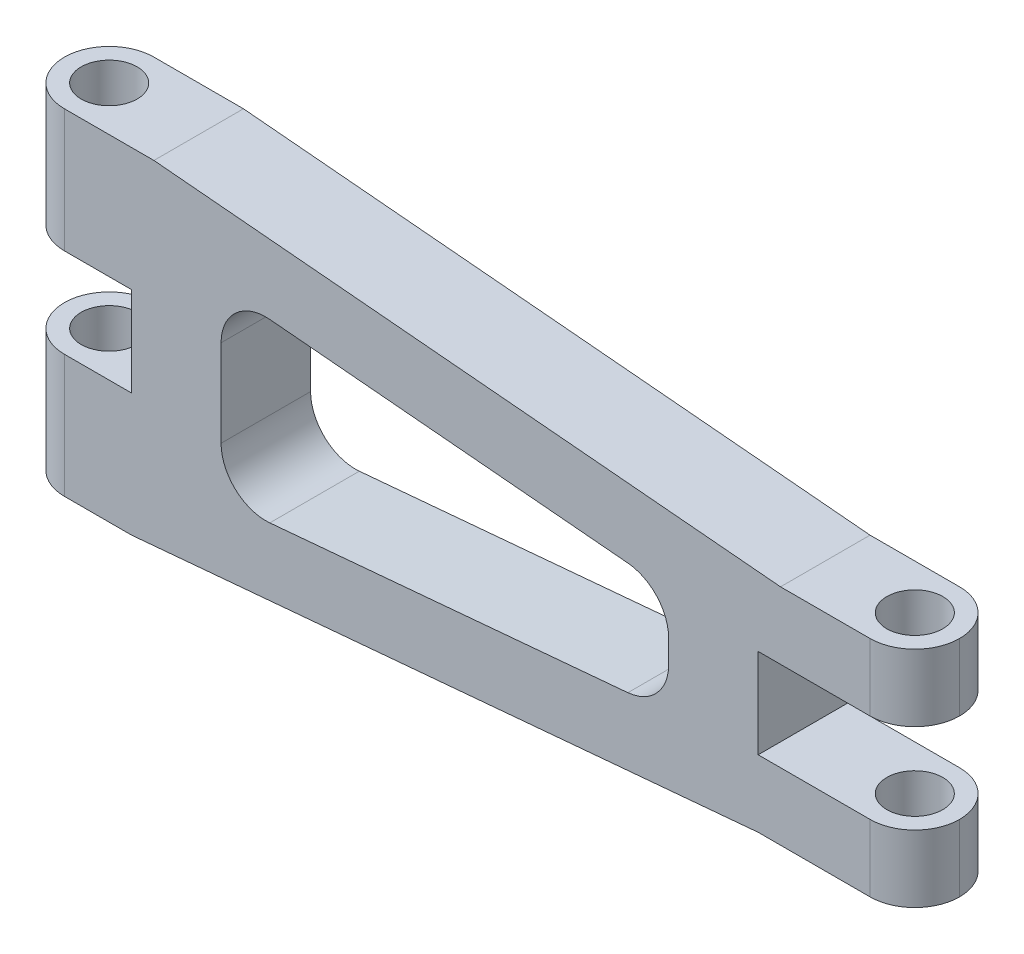
ISO-10303-21;
HEADER;
FILE_DESCRIPTION(('STEP AP214'),'2;1');
FILE_NAME('part.step','',(''),(''),'','','');
FILE_SCHEMA(('AUTOMOTIVE_DESIGN { 1 0 10303 214 1 1 1 1 }'));
ENDSEC;
DATA;
#1=APPLICATION_CONTEXT('core data for automotive mechanical design processes');
#2=APPLICATION_PROTOCOL_DEFINITION('international standard','automotive_design',2000,#1);
#3=PRODUCT_CONTEXT('',#1,'mechanical');
#4=PRODUCT('Part','Part','',(#3));
#5=PRODUCT_RELATED_PRODUCT_CATEGORY('part','',(#4));
#6=PRODUCT_DEFINITION_FORMATION('','',#4);
#7=PRODUCT_DEFINITION_CONTEXT('part definition',#1,'design');
#8=PRODUCT_DEFINITION('design','',#6,#7);
#9=PRODUCT_DEFINITION_SHAPE('','',#8);
#10=(LENGTH_UNIT() NAMED_UNIT(*) SI_UNIT(.MILLI.,.METRE.));
#11=(NAMED_UNIT(*) PLANE_ANGLE_UNIT() SI_UNIT($,.RADIAN.));
#12=(NAMED_UNIT(*) SI_UNIT($,.STERADIAN.) SOLID_ANGLE_UNIT());
#13=UNCERTAINTY_MEASURE_WITH_UNIT(LENGTH_MEASURE(1.E-05),#10,'distance_accuracy_value','');
#14=(GEOMETRIC_REPRESENTATION_CONTEXT(3) GLOBAL_UNCERTAINTY_ASSIGNED_CONTEXT((#13)) GLOBAL_UNIT_ASSIGNED_CONTEXT((#10,
#11,#12)) REPRESENTATION_CONTEXT('',''));
#15=CARTESIAN_POINT('',(0.,0.,0.));
#16=DIRECTION('',(0.,0.,1.));
#17=DIRECTION('',(1.,0.,0.));
#18=AXIS2_PLACEMENT_3D('',#15,#16,#17);
#19=CARTESIAN_POINT('',(-24.646070990319,37.5,20.));
#20=DIRECTION('',(0.,0.,1.));
#21=DIRECTION('',(1.,0.,0.));
#22=AXIS2_PLACEMENT_3D('',#19,#20,#21);
#23=PLANE('',#22);
#24=DIRECTION('',(-1.,0.,0.));
#25=VECTOR('',#24,1.);
#26=CARTESIAN_POINT('',(5.35137052106982,37.5,20.));
#27=LINE('',#26,#25);
#28=CARTESIAN_POINT('',(5.35137052106982,37.5,20.));
#29=VERTEX_POINT('',#28);
#30=CARTESIAN_POINT('',(-14.646070990319,37.5,20.));
#31=VERTEX_POINT('',#30);
#32=EDGE_CURVE('E239',#29,#31,#27,.T.);
#33=ORIENTED_EDGE('',*,*,#32,.T.);
#34=DIRECTION('',(0.,-1.,0.));
#35=VECTOR('',#34,1.);
#36=CARTESIAN_POINT('',(-14.646070990319,9.99999999999999,20.));
#37=LINE('',#36,#35);
#38=CARTESIAN_POINT('',(-14.646070990319,9.99999999999999,20.));
#39=VERTEX_POINT('',#38);
#40=EDGE_CURVE('E236',#31,#39,#37,.T.);
#41=ORIENTED_EDGE('',*,*,#40,.T.);
#42=DIRECTION('',(1.,0.,0.));
#43=VECTOR('',#42,1.);
#44=CARTESIAN_POINT('',(-24.646070990319,9.99999999999999,20.));
#45=LINE('',#44,#43);
#46=CARTESIAN_POINT('',(0.353929009681016,9.99999999999999,20.));
#47=VERTEX_POINT('',#46);
#48=EDGE_CURVE('E229',#39,#47,#45,.T.);
#49=ORIENTED_EDGE('',*,*,#48,.T.);
#50=DIRECTION('',(0.,1.,0.));
#51=VECTOR('',#50,1.);
#52=CARTESIAN_POINT('',(0.353929009681016,-10.,20.));
#53=LINE('',#52,#51);
#54=CARTESIAN_POINT('',(0.353929009681016,-10.,20.));
#55=VERTEX_POINT('',#54);
#56=EDGE_CURVE('E234',#55,#47,#53,.T.);
#57=ORIENTED_EDGE('',*,*,#56,.F.);
#58=DIRECTION('',(-1.,0.,0.));
#59=VECTOR('',#58,1.);
#60=CARTESIAN_POINT('',(0.353929009681016,-10.,20.));
#61=LINE('',#60,#59);
#62=CARTESIAN_POINT('',(-14.646070990319,-10.,20.));
#63=VERTEX_POINT('',#62);
#64=EDGE_CURVE('E254',#55,#63,#61,.T.);
#65=ORIENTED_EDGE('',*,*,#64,.T.);
#66=DIRECTION('',(0.,-1.,0.));
#67=VECTOR('',#66,1.);
#68=CARTESIAN_POINT('',(-14.646070990319,-37.5,20.));
#69=LINE('',#68,#67);
#70=CARTESIAN_POINT('',(-14.646070990319,-37.5,20.));
#71=VERTEX_POINT('',#70);
#72=EDGE_CURVE('E350',#63,#71,#69,.T.);
#73=ORIENTED_EDGE('',*,*,#72,.T.);
#74=DIRECTION('',(-1.,0.,0.));
#75=VECTOR('',#74,1.);
#76=CARTESIAN_POINT('',(0.353929009681009,-37.5,20.));
#77=LINE('',#76,#75);
#78=CARTESIAN_POINT('',(0.353929009681009,-37.5,20.));
#79=VERTEX_POINT('',#78);
#80=EDGE_CURVE('E256',#79,#71,#77,.T.);
#81=ORIENTED_EDGE('',*,*,#80,.F.);
#82=DIRECTION('',(-0.996037705314462,-0.0889319379745055,0.));
#83=VECTOR('',#82,1.);
#84=CARTESIAN_POINT('',(140.353929009681,-25.,20.));
#85=LINE('',#84,#83);
#86=CARTESIAN_POINT('',(140.353929009681,-25.,20.));
#87=VERTEX_POINT('',#86);
#88=EDGE_CURVE('E262',#87,#79,#85,.T.);
#89=ORIENTED_EDGE('',*,*,#88,.F.);
#90=DIRECTION('',(1.,0.,0.));
#91=VECTOR('',#90,1.);
#92=CARTESIAN_POINT('',(140.353929009681,-25.,20.));
#93=LINE('',#92,#91);
#94=CARTESIAN_POINT('',(165.353929009681,-25.,20.));
#95=VERTEX_POINT('',#94);
#96=EDGE_CURVE('E265',#87,#95,#93,.T.);
#97=ORIENTED_EDGE('',*,*,#96,.T.);
#98=DIRECTION('',(0.,-1.,0.));
#99=VECTOR('',#98,1.);
#100=CARTESIAN_POINT('',(165.353929009681,37.5,20.));
#101=LINE('',#100,#99);
#102=CARTESIAN_POINT('',(165.353929009681,-10.,20.));
#103=VERTEX_POINT('',#102);
#104=EDGE_CURVE('E345',#95,#103,#101,.F.);
#105=ORIENTED_EDGE('',*,*,#104,.T.);
#106=DIRECTION('',(1.,0.,0.));
#107=VECTOR('',#106,1.);
#108=CARTESIAN_POINT('',(140.353929009681,-10.,20.));
#109=LINE('',#108,#107);
#110=CARTESIAN_POINT('',(140.353929009681,-10.,20.));
#111=VERTEX_POINT('',#110);
#112=EDGE_CURVE('E268',#111,#103,#109,.T.);
#113=ORIENTED_EDGE('',*,*,#112,.F.);
#114=DIRECTION('',(0.,1.,0.));
#115=VECTOR('',#114,1.);
#116=CARTESIAN_POINT('',(140.353929009681,-10.,20.));
#117=LINE('',#116,#115);
#118=CARTESIAN_POINT('',(140.353929009681,10.,20.));
#119=VERTEX_POINT('',#118);
#120=EDGE_CURVE('E271',#111,#119,#117,.T.);
#121=ORIENTED_EDGE('',*,*,#120,.T.);
#122=DIRECTION('',(-1.,0.,0.));
#123=VECTOR('',#122,1.);
#124=CARTESIAN_POINT('',(175.353929009681,9.99999999999999,20.));
#125=LINE('',#124,#123);
#126=CARTESIAN_POINT('',(165.353929009681,10.,20.));
#127=VERTEX_POINT('',#126);
#128=EDGE_CURVE('E274',#127,#119,#125,.T.);
#129=ORIENTED_EDGE('',*,*,#128,.F.);
#130=DIRECTION('',(0.,-1.,0.));
#131=VECTOR('',#130,1.);
#132=CARTESIAN_POINT('',(165.353929009681,37.5,20.));
#133=LINE('',#132,#131);
#134=CARTESIAN_POINT('',(165.353929009681,25.,20.));
#135=VERTEX_POINT('',#134);
#136=EDGE_CURVE('E348',#127,#135,#133,.F.);
#137=ORIENTED_EDGE('',*,*,#136,.T.);
#138=DIRECTION('',(1.,0.,0.));
#139=VECTOR('',#138,1.);
#140=CARTESIAN_POINT('',(145.35137052107,25.,20.));
#141=LINE('',#140,#139);
#142=CARTESIAN_POINT('',(145.35137052107,25.,20.));
#143=VERTEX_POINT('',#142);
#144=EDGE_CURVE('E276',#143,#135,#141,.T.);
#145=ORIENTED_EDGE('',*,*,#144,.F.);
#146=DIRECTION('',(-0.996037705314462,0.0889319379745055,0.));
#147=VECTOR('',#146,1.);
#148=CARTESIAN_POINT('',(145.35137052107,25.,20.));
#149=LINE('',#148,#147);
#150=EDGE_CURVE('E279',#143,#29,#149,.T.);
#151=ORIENTED_EDGE('',*,*,#150,.T.);
#152=EDGE_LOOP('',(#33,#41,#49,#57,#65,#73,#81,#89,#97,#105,#113,#121,#129,#137,#145,#151));
#153=FACE_BOUND('',#152,.T.);
#154=DIRECTION('',(-0.996037705314462,0.0889319379745054,0.));
#155=VECTOR('',#154,1.);
#156=CARTESIAN_POINT('',(120.353929009681,11.7260434319244,20.));
#157=LINE('',#156,#155);
#158=CARTESIAN_POINT('',(111.243248389426,12.5394970587329,20.));
#159=VERTEX_POINT('',#158);
#160=CARTESIAN_POINT('',(31.2432483894261,19.68235420159,20.));
#161=VERTEX_POINT('',#160);
#162=EDGE_CURVE('E445',#159,#161,#157,.T.);
#163=ORIENTED_EDGE('',*,*,#162,.F.);
#164=CARTESIAN_POINT('',(110.353929009681,2.57912000558823,20.));
#165=DIRECTION('',(0.,0.,1.));
#166=DIRECTION('',(1.,0.,0.));
#167=AXIS2_PLACEMENT_3D('',#164,#165,#166);
#168=CIRCLE('',#167,10.);
#169=CARTESIAN_POINT('',(120.353929009681,2.57912000558823,20.));
#170=VERTEX_POINT('',#169);
#171=EDGE_CURVE('E58',#159,#170,#168,.F.);
#172=ORIENTED_EDGE('',*,*,#171,.T.);
#173=DIRECTION('',(0.,1.,0.));
#174=VECTOR('',#173,1.);
#175=CARTESIAN_POINT('',(120.353929009681,-11.7260434319244,20.));
#176=LINE('',#175,#174);
#177=CARTESIAN_POINT('',(120.353929009681,-2.57912000558823,20.));
#178=VERTEX_POINT('',#177);
#179=EDGE_CURVE('E438',#178,#170,#176,.T.);
#180=ORIENTED_EDGE('',*,*,#179,.F.);
#181=CARTESIAN_POINT('',(110.353929009681,-2.57912000558823,20.));
#182=DIRECTION('',(0.,0.,1.));
#183=DIRECTION('',(1.,0.,0.));
#184=AXIS2_PLACEMENT_3D('',#181,#182,#183);
#185=CIRCLE('',#184,10.);
#186=CARTESIAN_POINT('',(111.243248389426,-12.5394970587329,20.));
#187=VERTEX_POINT('',#186);
#188=EDGE_CURVE('E11',#178,#187,#185,.F.);
#189=ORIENTED_EDGE('',*,*,#188,.T.);
#190=DIRECTION('',(-0.996037705314462,-0.0889319379745054,0.));
#191=VECTOR('',#190,1.);
#192=CARTESIAN_POINT('',(120.353929009681,-11.7260434319244,20.));
#193=LINE('',#192,#191);
#194=CARTESIAN_POINT('',(31.2432483894261,-19.68235420159,20.));
#195=VERTEX_POINT('',#194);
#196=EDGE_CURVE('E285',#187,#195,#193,.T.);
#197=ORIENTED_EDGE('',*,*,#196,.T.);
#198=CARTESIAN_POINT('',(30.353929009681,-9.72197714844537,20.));
#199=DIRECTION('',(0.,0.,1.));
#200=DIRECTION('',(1.,0.,0.));
#201=AXIS2_PLACEMENT_3D('',#198,#199,#200);
#202=CIRCLE('',#201,10.);
#203=CARTESIAN_POINT('',(20.353929009681,-9.72197714844537,20.));
#204=VERTEX_POINT('',#203);
#205=EDGE_CURVE('E417',#195,#204,#202,.F.);
#206=ORIENTED_EDGE('',*,*,#205,.T.);
#207=DIRECTION('',(0.,-1.,0.));
#208=VECTOR('',#207,1.);
#209=CARTESIAN_POINT('',(20.353929009681,20.6546148604958,20.));
#210=LINE('',#209,#208);
#211=CARTESIAN_POINT('',(20.353929009681,9.72197714844537,20.));
#212=VERTEX_POINT('',#211);
#213=EDGE_CURVE('E442',#212,#204,#210,.T.);
#214=ORIENTED_EDGE('',*,*,#213,.F.);
#215=CARTESIAN_POINT('',(30.353929009681,9.72197714844537,20.));
#216=DIRECTION('',(0.,0.,1.));
#217=DIRECTION('',(1.,0.,0.));
#218=AXIS2_PLACEMENT_3D('',#215,#216,#217);
#219=CIRCLE('',#218,10.);
#220=EDGE_CURVE('E413',#212,#161,#219,.F.);
#221=ORIENTED_EDGE('',*,*,#220,.T.);
#222=EDGE_LOOP('',(#163,#172,#180,#189,#197,#206,#214,#221));
#223=FACE_BOUND('',#222,.T.);
#224=ADVANCED_FACE('F42',(#153,#223),#23,.T.);
#225=CARTESIAN_POINT('',(-24.646070990319,37.5,0.));
#226=DIRECTION('',(0.,0.,1.));
#227=DIRECTION('',(1.,0.,0.));
#228=AXIS2_PLACEMENT_3D('',#225,#226,#227);
#229=PLANE('',#228);
#230=DIRECTION('',(1.,0.,0.));
#231=VECTOR('',#230,1.);
#232=CARTESIAN_POINT('',(-24.646070990319,9.99999999999999,0.));
#233=LINE('',#232,#231);
#234=CARTESIAN_POINT('',(-14.646070990319,9.99999999999999,0.));
#235=VERTEX_POINT('',#234);
#236=CARTESIAN_POINT('',(0.353929009681016,9.99999999999999,0.));
#237=VERTEX_POINT('',#236);
#238=EDGE_CURVE('E245',#235,#237,#233,.T.);
#239=ORIENTED_EDGE('',*,*,#238,.F.);
#240=DIRECTION('',(0.,-1.,0.));
#241=VECTOR('',#240,1.);
#242=CARTESIAN_POINT('',(-14.646070990319,37.5,0.));
#243=LINE('',#242,#241);
#244=CARTESIAN_POINT('',(-14.646070990319,37.5,0.));
#245=VERTEX_POINT('',#244);
#246=EDGE_CURVE('E338',#235,#245,#243,.F.);
#247=ORIENTED_EDGE('',*,*,#246,.T.);
#248=DIRECTION('',(-1.,0.,0.));
#249=VECTOR('',#248,1.);
#250=CARTESIAN_POINT('',(5.35137052106982,37.5,0.));
#251=LINE('',#250,#249);
#252=CARTESIAN_POINT('',(5.35137052106982,37.5,0.));
#253=VERTEX_POINT('',#252);
#254=EDGE_CURVE('E282',#253,#245,#251,.T.);
#255=ORIENTED_EDGE('',*,*,#254,.F.);
#256=DIRECTION('',(-0.996037705314462,0.0889319379745055,0.));
#257=VECTOR('',#256,1.);
#258=CARTESIAN_POINT('',(145.35137052107,25.,0.));
#259=LINE('',#258,#257);
#260=CARTESIAN_POINT('',(145.35137052107,25.,0.));
#261=VERTEX_POINT('',#260);
#262=EDGE_CURVE('E312',#261,#253,#259,.T.);
#263=ORIENTED_EDGE('',*,*,#262,.F.);
#264=DIRECTION('',(1.,0.,0.));
#265=VECTOR('',#264,1.);
#266=CARTESIAN_POINT('',(145.35137052107,25.,0.));
#267=LINE('',#266,#265);
#268=CARTESIAN_POINT('',(165.353929009681,25.,0.));
#269=VERTEX_POINT('',#268);
#270=EDGE_CURVE('E309',#261,#269,#267,.T.);
#271=ORIENTED_EDGE('',*,*,#270,.T.);
#272=DIRECTION('',(0.,-1.,0.));
#273=VECTOR('',#272,1.);
#274=CARTESIAN_POINT('',(165.353929009681,9.99999999999999,0.));
#275=LINE('',#274,#273);
#276=CARTESIAN_POINT('',(165.353929009681,10.,0.));
#277=VERTEX_POINT('',#276);
#278=EDGE_CURVE('E333',#269,#277,#275,.T.);
#279=ORIENTED_EDGE('',*,*,#278,.T.);
#280=DIRECTION('',(-1.,0.,0.));
#281=VECTOR('',#280,1.);
#282=CARTESIAN_POINT('',(175.353929009681,9.99999999999999,0.));
#283=LINE('',#282,#281);
#284=CARTESIAN_POINT('',(140.353929009681,10.,0.));
#285=VERTEX_POINT('',#284);
#286=EDGE_CURVE('E307',#277,#285,#283,.T.);
#287=ORIENTED_EDGE('',*,*,#286,.T.);
#288=DIRECTION('',(0.,1.,0.));
#289=VECTOR('',#288,1.);
#290=CARTESIAN_POINT('',(140.353929009681,-10.,0.));
#291=LINE('',#290,#289);
#292=CARTESIAN_POINT('',(140.353929009681,-10.,0.));
#293=VERTEX_POINT('',#292);
#294=EDGE_CURVE('E304',#293,#285,#291,.T.);
#295=ORIENTED_EDGE('',*,*,#294,.F.);
#296=DIRECTION('',(1.,0.,0.));
#297=VECTOR('',#296,1.);
#298=CARTESIAN_POINT('',(140.353929009681,-10.,0.));
#299=LINE('',#298,#297);
#300=CARTESIAN_POINT('',(165.353929009681,-10.,0.));
#301=VERTEX_POINT('',#300);
#302=EDGE_CURVE('E301',#293,#301,#299,.T.);
#303=ORIENTED_EDGE('',*,*,#302,.T.);
#304=DIRECTION('',(0.,-1.,0.));
#305=VECTOR('',#304,1.);
#306=CARTESIAN_POINT('',(165.353929009681,-25.,0.));
#307=LINE('',#306,#305);
#308=CARTESIAN_POINT('',(165.353929009681,-25.,0.));
#309=VERTEX_POINT('',#308);
#310=EDGE_CURVE('E331',#301,#309,#307,.T.);
#311=ORIENTED_EDGE('',*,*,#310,.T.);
#312=DIRECTION('',(1.,0.,0.));
#313=VECTOR('',#312,1.);
#314=CARTESIAN_POINT('',(140.353929009681,-25.,0.));
#315=LINE('',#314,#313);
#316=CARTESIAN_POINT('',(140.353929009681,-25.,0.));
#317=VERTEX_POINT('',#316);
#318=EDGE_CURVE('E298',#317,#309,#315,.T.);
#319=ORIENTED_EDGE('',*,*,#318,.F.);
#320=DIRECTION('',(-0.996037705314462,-0.0889319379745055,0.));
#321=VECTOR('',#320,1.);
#322=CARTESIAN_POINT('',(140.353929009681,-25.,0.));
#323=LINE('',#322,#321);
#324=CARTESIAN_POINT('',(0.353929009681009,-37.5,0.));
#325=VERTEX_POINT('',#324);
#326=EDGE_CURVE('E295',#317,#325,#323,.T.);
#327=ORIENTED_EDGE('',*,*,#326,.T.);
#328=DIRECTION('',(-1.,0.,0.));
#329=VECTOR('',#328,1.);
#330=CARTESIAN_POINT('',(0.353929009681009,-37.5,0.));
#331=LINE('',#330,#329);
#332=CARTESIAN_POINT('',(-14.646070990319,-37.5,0.));
#333=VERTEX_POINT('',#332);
#334=EDGE_CURVE('E292',#325,#333,#331,.T.);
#335=ORIENTED_EDGE('',*,*,#334,.T.);
#336=DIRECTION('',(0.,-1.,0.));
#337=VECTOR('',#336,1.);
#338=CARTESIAN_POINT('',(-14.646070990319,37.5,0.));
#339=LINE('',#338,#337);
#340=CARTESIAN_POINT('',(-14.646070990319,-10.,0.));
#341=VERTEX_POINT('',#340);
#342=EDGE_CURVE('E336',#333,#341,#339,.F.);
#343=ORIENTED_EDGE('',*,*,#342,.T.);
#344=DIRECTION('',(-1.,0.,0.));
#345=VECTOR('',#344,1.);
#346=CARTESIAN_POINT('',(0.353929009681016,-10.,0.));
#347=LINE('',#346,#345);
#348=CARTESIAN_POINT('',(0.353929009681016,-10.,0.));
#349=VERTEX_POINT('',#348);
#350=EDGE_CURVE('E289',#349,#341,#347,.T.);
#351=ORIENTED_EDGE('',*,*,#350,.F.);
#352=DIRECTION('',(0.,1.,0.));
#353=VECTOR('',#352,1.);
#354=CARTESIAN_POINT('',(0.353929009681016,-10.,0.));
#355=LINE('',#354,#353);
#356=EDGE_CURVE('E287',#349,#237,#355,.T.);
#357=ORIENTED_EDGE('',*,*,#356,.T.);
#358=EDGE_LOOP('',(#239,#247,#255,#263,#271,#279,#287,#295,#303,#311,#319,#327,#335,#343,#351,#357));
#359=FACE_BOUND('',#358,.T.);
#360=DIRECTION('',(-0.996037705314462,-0.0889319379745054,0.));
#361=VECTOR('',#360,1.);
#362=CARTESIAN_POINT('',(120.353929009681,-11.7260434319244,0.));
#363=LINE('',#362,#361);
#364=CARTESIAN_POINT('',(111.243248389426,-12.5394970587329,0.));
#365=VERTEX_POINT('',#364);
#366=CARTESIAN_POINT('',(31.2432483894261,-19.68235420159,0.));
#367=VERTEX_POINT('',#366);
#368=EDGE_CURVE('E427',#365,#367,#363,.T.);
#369=ORIENTED_EDGE('',*,*,#368,.F.);
#370=CARTESIAN_POINT('',(110.353929009681,-2.57912000558823,0.));
#371=DIRECTION('',(0.,0.,1.));
#372=DIRECTION('',(1.,0.,0.));
#373=AXIS2_PLACEMENT_3D('',#370,#371,#372);
#374=CIRCLE('',#373,10.);
#375=CARTESIAN_POINT('',(120.353929009681,-2.57912000558823,0.));
#376=VERTEX_POINT('',#375);
#377=EDGE_CURVE('E51',#365,#376,#374,.T.);
#378=ORIENTED_EDGE('',*,*,#377,.T.);
#379=DIRECTION('',(0.,1.,0.));
#380=VECTOR('',#379,1.);
#381=CARTESIAN_POINT('',(120.353929009681,-11.7260434319244,0.));
#382=LINE('',#381,#380);
#383=CARTESIAN_POINT('',(120.353929009681,2.57912000558823,0.));
#384=VERTEX_POINT('',#383);
#385=EDGE_CURVE('E382',#376,#384,#382,.T.);
#386=ORIENTED_EDGE('',*,*,#385,.T.);
#387=CARTESIAN_POINT('',(110.353929009681,2.57912000558823,0.));
#388=DIRECTION('',(0.,0.,1.));
#389=DIRECTION('',(1.,0.,0.));
#390=AXIS2_PLACEMENT_3D('',#387,#388,#389);
#391=CIRCLE('',#390,10.);
#392=CARTESIAN_POINT('',(111.243248389426,12.5394970587329,0.));
#393=VERTEX_POINT('',#392);
#394=EDGE_CURVE('E419',#384,#393,#391,.T.);
#395=ORIENTED_EDGE('',*,*,#394,.T.);
#396=DIRECTION('',(-0.996037705314462,0.0889319379745054,0.));
#397=VECTOR('',#396,1.);
#398=CARTESIAN_POINT('',(120.353929009681,11.7260434319244,0.));
#399=LINE('',#398,#397);
#400=CARTESIAN_POINT('',(31.2432483894261,19.68235420159,0.));
#401=VERTEX_POINT('',#400);
#402=EDGE_CURVE('E432',#393,#401,#399,.T.);
#403=ORIENTED_EDGE('',*,*,#402,.T.);
#404=CARTESIAN_POINT('',(30.353929009681,9.72197714844537,0.));
#405=DIRECTION('',(0.,0.,1.));
#406=DIRECTION('',(1.,0.,0.));
#407=AXIS2_PLACEMENT_3D('',#404,#405,#406);
#408=CIRCLE('',#407,10.);
#409=CARTESIAN_POINT('',(20.353929009681,9.72197714844537,0.));
#410=VERTEX_POINT('',#409);
#411=EDGE_CURVE('E411',#401,#410,#408,.T.);
#412=ORIENTED_EDGE('',*,*,#411,.T.);
#413=DIRECTION('',(0.,-1.,0.));
#414=VECTOR('',#413,1.);
#415=CARTESIAN_POINT('',(20.353929009681,20.6546148604958,0.));
#416=LINE('',#415,#414);
#417=CARTESIAN_POINT('',(20.353929009681,-9.72197714844537,0.));
#418=VERTEX_POINT('',#417);
#419=EDGE_CURVE('E451',#410,#418,#416,.T.);
#420=ORIENTED_EDGE('',*,*,#419,.T.);
#421=CARTESIAN_POINT('',(30.353929009681,-9.72197714844537,0.));
#422=DIRECTION('',(0.,0.,1.));
#423=DIRECTION('',(1.,0.,0.));
#424=AXIS2_PLACEMENT_3D('',#421,#422,#423);
#425=CIRCLE('',#424,10.);
#426=EDGE_CURVE('E415',#418,#367,#425,.T.);
#427=ORIENTED_EDGE('',*,*,#426,.T.);
#428=EDGE_LOOP('',(#369,#378,#386,#395,#403,#412,#420,#427));
#429=FACE_BOUND('',#428,.T.);
#430=ADVANCED_FACE('F425',(#359,#429),#229,.F.);
#431=CARTESIAN_POINT('',(5.35137052106982,37.5,20.));
#432=DIRECTION('',(0.,-1.,0.));
#433=DIRECTION('',(1.,0.,0.));
#434=AXIS2_PLACEMENT_3D('',#431,#432,#433);
#435=PLANE('',#434);
#436=CARTESIAN_POINT('',(-14.646070990319,37.5,10.));
#437=DIRECTION('',(0.,1.,0.));
#438=DIRECTION('',(0.,0.,1.));
#439=AXIS2_PLACEMENT_3D('',#436,#437,#438);
#440=CIRCLE('',#439,6.25);
#441=CARTESIAN_POINT('',(-14.646070990319,37.5,16.25));
#442=VERTEX_POINT('',#441);
#443=EDGE_CURVE('E986',#442,#442,#440,.T.);
#444=ORIENTED_EDGE('',*,*,#443,.F.);
#445=EDGE_LOOP('',(#444));
#446=FACE_BOUND('',#445,.T.);
#447=ORIENTED_EDGE('',*,*,#254,.T.);
#448=CARTESIAN_POINT('',(-14.646070990319,37.5,10.));
#449=DIRECTION('',(0.,-1.,0.));
#450=DIRECTION('',(1.,0.,0.));
#451=AXIS2_PLACEMENT_3D('',#448,#449,#450);
#452=CIRCLE('',#451,10.);
#453=CARTESIAN_POINT('',(-24.646070990319,37.5,10.));
#454=VERTEX_POINT('',#453);
#455=EDGE_CURVE('E343',#245,#454,#452,.F.);
#456=ORIENTED_EDGE('',*,*,#455,.T.);
#457=CARTESIAN_POINT('',(-14.646070990319,37.5,10.));
#458=DIRECTION('',(0.,-1.,0.));
#459=DIRECTION('',(1.,0.,0.));
#460=AXIS2_PLACEMENT_3D('',#457,#458,#459);
#461=CIRCLE('',#460,10.);
#462=EDGE_CURVE('E341',#454,#31,#461,.F.);
#463=ORIENTED_EDGE('',*,*,#462,.T.);
#464=ORIENTED_EDGE('',*,*,#32,.F.);
#465=DIRECTION('',(0.,0.,-1.));
#466=VECTOR('',#465,1.);
#467=CARTESIAN_POINT('',(5.35137052106982,37.5,20.));
#468=LINE('',#467,#466);
#469=EDGE_CURVE('E281',#29,#253,#468,.T.);
#470=ORIENTED_EDGE('',*,*,#469,.T.);
#471=EDGE_LOOP('',(#447,#456,#463,#464,#470));
#472=FACE_BOUND('',#471,.T.);
#473=ADVANCED_FACE('F470',(#446,#472),#435,.F.);
#474=CARTESIAN_POINT('',(-24.646070990319,9.99999999999999,20.));
#475=DIRECTION('',(0.,1.,0.));
#476=DIRECTION('',(0.,0.,1.));
#477=AXIS2_PLACEMENT_3D('',#474,#475,#476);
#478=PLANE('',#477);
#479=CARTESIAN_POINT('',(-14.646070990319,9.99999999999999,10.));
#480=DIRECTION('',(0.,1.,0.));
#481=DIRECTION('',(0.,0.,1.));
#482=AXIS2_PLACEMENT_3D('',#479,#480,#481);
#483=CIRCLE('',#482,6.25);
#484=CARTESIAN_POINT('',(-14.646070990319,9.99999999999999,16.25));
#485=VERTEX_POINT('',#484);
#486=EDGE_CURVE('E989',#485,#485,#483,.T.);
#487=ORIENTED_EDGE('',*,*,#486,.T.);
#488=EDGE_LOOP('',(#487));
#489=FACE_BOUND('',#488,.T.);
#490=CARTESIAN_POINT('',(-14.646070990319,9.99999999999999,10.));
#491=DIRECTION('',(0.,1.,0.));
#492=DIRECTION('',(0.,0.,1.));
#493=AXIS2_PLACEMENT_3D('',#490,#491,#492);
#494=CIRCLE('',#493,10.);
#495=CARTESIAN_POINT('',(-24.646070990319,9.99999999999999,10.));
#496=VERTEX_POINT('',#495);
#497=EDGE_CURVE('E249',#39,#496,#494,.F.);
#498=ORIENTED_EDGE('',*,*,#497,.T.);
#499=CARTESIAN_POINT('',(-14.646070990319,9.99999999999999,10.));
#500=DIRECTION('',(0.,1.,0.));
#501=DIRECTION('',(0.,0.,1.));
#502=AXIS2_PLACEMENT_3D('',#499,#500,#501);
#503=CIRCLE('',#502,10.);
#504=EDGE_CURVE('E329',#496,#235,#503,.F.);
#505=ORIENTED_EDGE('',*,*,#504,.T.);
#506=ORIENTED_EDGE('',*,*,#238,.T.);
#507=DIRECTION('',(0.,0.,-1.));
#508=VECTOR('',#507,1.);
#509=CARTESIAN_POINT('',(0.353929009681016,9.99999999999999,20.));
#510=LINE('',#509,#508);
#511=EDGE_CURVE('E242',#47,#237,#510,.T.);
#512=ORIENTED_EDGE('',*,*,#511,.F.);
#513=ORIENTED_EDGE('',*,*,#48,.F.);
#514=EDGE_LOOP('',(#498,#505,#506,#512,#513));
#515=FACE_BOUND('',#514,.T.);
#516=ADVANCED_FACE('F243',(#489,#515),#478,.F.);
#517=CARTESIAN_POINT('',(0.353929009681016,-10.,20.));
#518=DIRECTION('',(-1.,0.,0.));
#519=DIRECTION('',(0.,0.,1.));
#520=AXIS2_PLACEMENT_3D('',#517,#518,#519);
#521=PLANE('',#520);
#522=ORIENTED_EDGE('',*,*,#356,.F.);
#523=DIRECTION('',(0.,0.,-1.));
#524=VECTOR('',#523,1.);
#525=CARTESIAN_POINT('',(0.353929009681016,-10.,20.));
#526=LINE('',#525,#524);
#527=EDGE_CURVE('E250',#55,#349,#526,.T.);
#528=ORIENTED_EDGE('',*,*,#527,.F.);
#529=ORIENTED_EDGE('',*,*,#56,.T.);
#530=ORIENTED_EDGE('',*,*,#511,.T.);
#531=EDGE_LOOP('',(#522,#528,#529,#530));
#532=FACE_BOUND('',#531,.T.);
#533=ADVANCED_FACE('F252',(#532),#521,.T.);
#534=CARTESIAN_POINT('',(0.353929009681016,-10.,20.));
#535=DIRECTION('',(0.,-1.,0.));
#536=DIRECTION('',(0.,0.,-1.));
#537=AXIS2_PLACEMENT_3D('',#534,#535,#536);
#538=PLANE('',#537);
#539=CARTESIAN_POINT('',(-14.646070990319,-10.,10.));
#540=DIRECTION('',(0.,-1.,0.));
#541=DIRECTION('',(0.,0.,-1.));
#542=AXIS2_PLACEMENT_3D('',#539,#540,#541);
#543=CIRCLE('',#542,6.25);
#544=CARTESIAN_POINT('',(-14.646070990319,-10.,3.75));
#545=VERTEX_POINT('',#544);
#546=EDGE_CURVE('E990',#545,#545,#543,.T.);
#547=ORIENTED_EDGE('',*,*,#546,.T.);
#548=EDGE_LOOP('',(#547));
#549=FACE_BOUND('',#548,.T.);
#550=CARTESIAN_POINT('',(-14.646070990319,-10.,10.));
#551=DIRECTION('',(0.,-1.,0.));
#552=DIRECTION('',(0.,0.,-1.));
#553=AXIS2_PLACEMENT_3D('',#550,#551,#552);
#554=CIRCLE('',#553,10.);
#555=CARTESIAN_POINT('',(-24.646070990319,-10.,10.));
#556=VERTEX_POINT('',#555);
#557=EDGE_CURVE('E358',#341,#556,#554,.F.);
#558=ORIENTED_EDGE('',*,*,#557,.T.);
#559=CARTESIAN_POINT('',(-14.646070990319,-10.,10.));
#560=DIRECTION('',(0.,-1.,0.));
#561=DIRECTION('',(0.,0.,-1.));
#562=AXIS2_PLACEMENT_3D('',#559,#560,#561);
#563=CIRCLE('',#562,10.);
#564=EDGE_CURVE('E360',#556,#63,#563,.F.);
#565=ORIENTED_EDGE('',*,*,#564,.T.);
#566=ORIENTED_EDGE('',*,*,#64,.F.);
#567=ORIENTED_EDGE('',*,*,#527,.T.);
#568=ORIENTED_EDGE('',*,*,#350,.T.);
#569=EDGE_LOOP('',(#558,#565,#566,#567,#568));
#570=FACE_BOUND('',#569,.T.);
#571=ADVANCED_FACE('F525',(#549,#570),#538,.F.);
#572=CARTESIAN_POINT('',(0.353929009681009,-37.5,20.));
#573=DIRECTION('',(0.,-1.,0.));
#574=DIRECTION('',(0.,0.,-1.));
#575=AXIS2_PLACEMENT_3D('',#572,#573,#574);
#576=PLANE('',#575);
#577=CARTESIAN_POINT('',(-14.646070990319,-37.5,10.));
#578=DIRECTION('',(0.,1.,0.));
#579=DIRECTION('',(0.,0.,1.));
#580=AXIS2_PLACEMENT_3D('',#577,#578,#579);
#581=CIRCLE('',#580,6.25);
#582=CARTESIAN_POINT('',(-14.646070990319,-37.5,16.25));
#583=VERTEX_POINT('',#582);
#584=EDGE_CURVE('E994',#583,#583,#581,.T.);
#585=ORIENTED_EDGE('',*,*,#584,.T.);
#586=EDGE_LOOP('',(#585));
#587=FACE_BOUND('',#586,.T.);
#588=ORIENTED_EDGE('',*,*,#80,.T.);
#589=CARTESIAN_POINT('',(-14.646070990319,-37.5,10.));
#590=DIRECTION('',(0.,-1.,0.));
#591=DIRECTION('',(0.,0.,-1.));
#592=AXIS2_PLACEMENT_3D('',#589,#590,#591);
#593=CIRCLE('',#592,10.);
#594=CARTESIAN_POINT('',(-24.646070990319,-37.5,10.));
#595=VERTEX_POINT('',#594);
#596=EDGE_CURVE('E356',#71,#595,#593,.T.);
#597=ORIENTED_EDGE('',*,*,#596,.T.);
#598=CARTESIAN_POINT('',(-14.646070990319,-37.5,10.));
#599=DIRECTION('',(0.,-1.,0.));
#600=DIRECTION('',(0.,0.,-1.));
#601=AXIS2_PLACEMENT_3D('',#598,#599,#600);
#602=CIRCLE('',#601,10.);
#603=EDGE_CURVE('E354',#595,#333,#602,.T.);
#604=ORIENTED_EDGE('',*,*,#603,.T.);
#605=ORIENTED_EDGE('',*,*,#334,.F.);
#606=DIRECTION('',(0.,0.,-1.));
#607=VECTOR('',#606,1.);
#608=CARTESIAN_POINT('',(0.353929009681009,-37.5,20.));
#609=LINE('',#608,#607);
#610=EDGE_CURVE('E325',#79,#325,#609,.T.);
#611=ORIENTED_EDGE('',*,*,#610,.F.);
#612=EDGE_LOOP('',(#588,#597,#604,#605,#611));
#613=FACE_BOUND('',#612,.T.);
#614=ADVANCED_FACE('F529',(#587,#613),#576,.T.);
#615=CARTESIAN_POINT('',(140.353929009681,-25.,20.));
#616=DIRECTION('',(0.0889319379745055,-0.996037705314462,0.));
#617=DIRECTION('',(0.996037705314462,0.0889319379745055,0.));
#618=AXIS2_PLACEMENT_3D('',#615,#616,#617);
#619=PLANE('',#618);
#620=ORIENTED_EDGE('',*,*,#326,.F.);
#621=DIRECTION('',(0.,0.,-1.));
#622=VECTOR('',#621,1.);
#623=CARTESIAN_POINT('',(140.353929009681,-25.,20.));
#624=LINE('',#623,#622);
#625=EDGE_CURVE('E323',#87,#317,#624,.T.);
#626=ORIENTED_EDGE('',*,*,#625,.F.);
#627=ORIENTED_EDGE('',*,*,#88,.T.);
#628=ORIENTED_EDGE('',*,*,#610,.T.);
#629=EDGE_LOOP('',(#620,#626,#627,#628));
#630=FACE_BOUND('',#629,.T.);
#631=ADVANCED_FACE('F513',(#630),#619,.T.);
#632=CARTESIAN_POINT('',(140.353929009681,-25.,20.));
#633=DIRECTION('',(0.,1.,0.));
#634=DIRECTION('',(-1.,0.,0.));
#635=AXIS2_PLACEMENT_3D('',#632,#633,#634);
#636=PLANE('',#635);
#637=CARTESIAN_POINT('',(165.353929009681,-25.,10.));
#638=DIRECTION('',(0.,1.,0.));
#639=DIRECTION('',(-1.,0.,0.));
#640=AXIS2_PLACEMENT_3D('',#637,#638,#639);
#641=CIRCLE('',#640,6.25);
#642=CARTESIAN_POINT('',(159.103929009681,-25.,10.));
#643=VERTEX_POINT('',#642);
#644=EDGE_CURVE('E392',#643,#643,#641,.T.);
#645=ORIENTED_EDGE('',*,*,#644,.T.);
#646=EDGE_LOOP('',(#645));
#647=FACE_BOUND('',#646,.T.);
#648=CARTESIAN_POINT('',(165.353929009681,-25.,10.));
#649=DIRECTION('',(0.,1.,0.));
#650=DIRECTION('',(-1.,0.,0.));
#651=AXIS2_PLACEMENT_3D('',#648,#649,#650);
#652=CIRCLE('',#651,10.);
#653=CARTESIAN_POINT('',(175.353929009681,-25.,10.));
#654=VERTEX_POINT('',#653);
#655=EDGE_CURVE('E370',#309,#654,#652,.F.);
#656=ORIENTED_EDGE('',*,*,#655,.T.);
#657=CARTESIAN_POINT('',(165.353929009681,-25.,10.));
#658=DIRECTION('',(0.,1.,0.));
#659=DIRECTION('',(-1.,0.,0.));
#660=AXIS2_PLACEMENT_3D('',#657,#658,#659);
#661=CIRCLE('',#660,10.);
#662=EDGE_CURVE('E372',#654,#95,#661,.F.);
#663=ORIENTED_EDGE('',*,*,#662,.T.);
#664=ORIENTED_EDGE('',*,*,#96,.F.);
#665=ORIENTED_EDGE('',*,*,#625,.T.);
#666=ORIENTED_EDGE('',*,*,#318,.T.);
#667=EDGE_LOOP('',(#656,#663,#664,#665,#666));
#668=FACE_BOUND('',#667,.T.);
#669=ADVANCED_FACE('F507',(#647,#668),#636,.F.);
#670=CARTESIAN_POINT('',(140.353929009681,-10.,20.));
#671=DIRECTION('',(0.,1.,0.));
#672=DIRECTION('',(-1.,0.,0.));
#673=AXIS2_PLACEMENT_3D('',#670,#671,#672);
#674=PLANE('',#673);
#675=CARTESIAN_POINT('',(165.353929009681,-10.,10.));
#676=DIRECTION('',(0.,1.,0.));
#677=DIRECTION('',(-1.,0.,0.));
#678=AXIS2_PLACEMENT_3D('',#675,#676,#677);
#679=CIRCLE('',#678,6.25);
#680=CARTESIAN_POINT('',(159.103929009681,-10.,10.));
#681=VERTEX_POINT('',#680);
#682=EDGE_CURVE('E571',#681,#681,#679,.T.);
#683=ORIENTED_EDGE('',*,*,#682,.F.);
#684=EDGE_LOOP('',(#683));
#685=FACE_BOUND('',#684,.T.);
#686=ORIENTED_EDGE('',*,*,#112,.T.);
#687=CARTESIAN_POINT('',(165.353929009681,-10.,10.));
#688=DIRECTION('',(0.,1.,0.));
#689=DIRECTION('',(-1.,0.,0.));
#690=AXIS2_PLACEMENT_3D('',#687,#688,#689);
#691=CIRCLE('',#690,10.);
#692=CARTESIAN_POINT('',(175.353929009681,-10.,10.));
#693=VERTEX_POINT('',#692);
#694=EDGE_CURVE('E376',#103,#693,#691,.T.);
#695=ORIENTED_EDGE('',*,*,#694,.T.);
#696=CARTESIAN_POINT('',(165.353929009681,-10.,10.));
#697=DIRECTION('',(0.,1.,0.));
#698=DIRECTION('',(-1.,0.,0.));
#699=AXIS2_PLACEMENT_3D('',#696,#697,#698);
#700=CIRCLE('',#699,10.);
#701=EDGE_CURVE('E374',#693,#301,#700,.T.);
#702=ORIENTED_EDGE('',*,*,#701,.T.);
#703=ORIENTED_EDGE('',*,*,#302,.F.);
#704=DIRECTION('',(0.,0.,-1.));
#705=VECTOR('',#704,1.);
#706=CARTESIAN_POINT('',(140.353929009681,-10.,20.));
#707=LINE('',#706,#705);
#708=EDGE_CURVE('E321',#111,#293,#707,.T.);
#709=ORIENTED_EDGE('',*,*,#708,.F.);
#710=EDGE_LOOP('',(#686,#695,#702,#703,#709));
#711=FACE_BOUND('',#710,.T.);
#712=ADVANCED_FACE('F495',(#685,#711),#674,.T.);
#713=CARTESIAN_POINT('',(140.353929009681,-10.,20.));
#714=DIRECTION('',(-1.,0.,0.));
#715=DIRECTION('',(0.,0.,1.));
#716=AXIS2_PLACEMENT_3D('',#713,#714,#715);
#717=PLANE('',#716);
#718=ORIENTED_EDGE('',*,*,#294,.T.);
#719=DIRECTION('',(0.,0.,-1.));
#720=VECTOR('',#719,1.);
#721=CARTESIAN_POINT('',(140.353929009681,10.,20.));
#722=LINE('',#721,#720);
#723=EDGE_CURVE('E318',#119,#285,#722,.T.);
#724=ORIENTED_EDGE('',*,*,#723,.F.);
#725=ORIENTED_EDGE('',*,*,#120,.F.);
#726=ORIENTED_EDGE('',*,*,#708,.T.);
#727=EDGE_LOOP('',(#718,#724,#725,#726));
#728=FACE_BOUND('',#727,.T.);
#729=ADVANCED_FACE('F491',(#728),#717,.F.);
#730=CARTESIAN_POINT('',(175.353929009681,9.99999999999999,20.));
#731=DIRECTION('',(0.,-1.,0.));
#732=DIRECTION('',(1.,0.,0.));
#733=AXIS2_PLACEMENT_3D('',#730,#731,#732);
#734=PLANE('',#733);
#735=CARTESIAN_POINT('',(165.353929009681,9.99999999999999,10.));
#736=DIRECTION('',(0.,-1.,0.));
#737=DIRECTION('',(1.,0.,0.));
#738=AXIS2_PLACEMENT_3D('',#735,#736,#737);
#739=CIRCLE('',#738,6.25);
#740=CARTESIAN_POINT('',(171.603929009681,9.99999999999999,10.));
#741=VERTEX_POINT('',#740);
#742=EDGE_CURVE('E574',#741,#741,#739,.T.);
#743=ORIENTED_EDGE('',*,*,#742,.F.);
#744=EDGE_LOOP('',(#743));
#745=FACE_BOUND('',#744,.T.);
#746=ORIENTED_EDGE('',*,*,#286,.F.);
#747=CARTESIAN_POINT('',(165.353929009681,9.99999999999999,10.));
#748=DIRECTION('',(0.,-1.,0.));
#749=DIRECTION('',(1.,0.,0.));
#750=AXIS2_PLACEMENT_3D('',#747,#748,#749);
#751=CIRCLE('',#750,10.);
#752=CARTESIAN_POINT('',(175.353929009681,9.99999999999999,10.));
#753=VERTEX_POINT('',#752);
#754=EDGE_CURVE('E364',#277,#753,#751,.T.);
#755=ORIENTED_EDGE('',*,*,#754,.T.);
#756=CARTESIAN_POINT('',(165.353929009681,10.,10.));
#757=DIRECTION('',(0.,-1.,0.));
#758=DIRECTION('',(1.,0.,0.));
#759=AXIS2_PLACEMENT_3D('',#756,#757,#758);
#760=CIRCLE('',#759,10.);
#761=EDGE_CURVE('E362',#753,#127,#760,.T.);
#762=ORIENTED_EDGE('',*,*,#761,.T.);
#763=ORIENTED_EDGE('',*,*,#128,.T.);
#764=ORIENTED_EDGE('',*,*,#723,.T.);
#765=EDGE_LOOP('',(#746,#755,#762,#763,#764));
#766=FACE_BOUND('',#765,.T.);
#767=ADVANCED_FACE('F485',(#745,#766),#734,.T.);
#768=CARTESIAN_POINT('',(145.35137052107,25.,20.));
#769=DIRECTION('',(0.,1.,0.));
#770=DIRECTION('',(-1.,0.,0.));
#771=AXIS2_PLACEMENT_3D('',#768,#769,#770);
#772=PLANE('',#771);
#773=CARTESIAN_POINT('',(165.353929009681,25.,10.));
#774=DIRECTION('',(0.,1.,0.));
#775=DIRECTION('',(-1.,0.,0.));
#776=AXIS2_PLACEMENT_3D('',#773,#774,#775);
#777=CIRCLE('',#776,6.25);
#778=CARTESIAN_POINT('',(159.103929009681,25.,10.));
#779=VERTEX_POINT('',#778);
#780=EDGE_CURVE('E46',#779,#779,#777,.T.);
#781=ORIENTED_EDGE('',*,*,#780,.F.);
#782=EDGE_LOOP('',(#781));
#783=FACE_BOUND('',#782,.T.);
#784=CARTESIAN_POINT('',(165.353929009681,25.,10.));
#785=DIRECTION('',(0.,1.,0.));
#786=DIRECTION('',(-1.,0.,0.));
#787=AXIS2_PLACEMENT_3D('',#784,#785,#786);
#788=CIRCLE('',#787,10.);
#789=CARTESIAN_POINT('',(175.353929009681,25.,10.));
#790=VERTEX_POINT('',#789);
#791=EDGE_CURVE('E366',#135,#790,#788,.T.);
#792=ORIENTED_EDGE('',*,*,#791,.T.);
#793=CARTESIAN_POINT('',(165.353929009681,25.,10.));
#794=DIRECTION('',(0.,1.,0.));
#795=DIRECTION('',(-1.,0.,0.));
#796=AXIS2_PLACEMENT_3D('',#793,#794,#795);
#797=CIRCLE('',#796,10.);
#798=EDGE_CURVE('E368',#790,#269,#797,.T.);
#799=ORIENTED_EDGE('',*,*,#798,.T.);
#800=ORIENTED_EDGE('',*,*,#270,.F.);
#801=DIRECTION('',(0.,0.,-1.));
#802=VECTOR('',#801,1.);
#803=CARTESIAN_POINT('',(145.35137052107,25.,20.));
#804=LINE('',#803,#802);
#805=EDGE_CURVE('E316',#143,#261,#804,.T.);
#806=ORIENTED_EDGE('',*,*,#805,.F.);
#807=ORIENTED_EDGE('',*,*,#144,.T.);
#808=EDGE_LOOP('',(#792,#799,#800,#806,#807));
#809=FACE_BOUND('',#808,.T.);
#810=ADVANCED_FACE('F476',(#783,#809),#772,.T.);
#811=CARTESIAN_POINT('',(145.35137052107,25.,20.));
#812=DIRECTION('',(-0.0889319379745055,-0.996037705314462,0.));
#813=DIRECTION('',(0.996037705314462,-0.0889319379745055,0.));
#814=AXIS2_PLACEMENT_3D('',#811,#812,#813);
#815=PLANE('',#814);
#816=ORIENTED_EDGE('',*,*,#262,.T.);
#817=ORIENTED_EDGE('',*,*,#469,.F.);
#818=ORIENTED_EDGE('',*,*,#150,.F.);
#819=ORIENTED_EDGE('',*,*,#805,.T.);
#820=EDGE_LOOP('',(#816,#817,#818,#819));
#821=FACE_BOUND('',#820,.T.);
#822=ADVANCED_FACE('F550',(#821),#815,.F.);
#823=CARTESIAN_POINT('',(120.353929009681,-11.7260434319244,20.));
#824=DIRECTION('',(-1.,0.,0.));
#825=DIRECTION('',(0.,0.,1.));
#826=AXIS2_PLACEMENT_3D('',#823,#824,#825);
#827=PLANE('',#826);
#828=ORIENTED_EDGE('',*,*,#179,.T.);
#829=DIRECTION('',(0.,0.,-1.));
#830=VECTOR('',#829,1.);
#831=CARTESIAN_POINT('',(120.353929009681,2.57912000558823,0.));
#832=LINE('',#831,#830);
#833=EDGE_CURVE('E408',#170,#384,#832,.T.);
#834=ORIENTED_EDGE('',*,*,#833,.T.);
#835=ORIENTED_EDGE('',*,*,#385,.F.);
#836=DIRECTION('',(0.,0.,-1.));
#837=VECTOR('',#836,1.);
#838=CARTESIAN_POINT('',(120.353929009681,-2.57912000558823,20.));
#839=LINE('',#838,#837);
#840=EDGE_CURVE('E65',#376,#178,#839,.F.);
#841=ORIENTED_EDGE('',*,*,#840,.T.);
#842=EDGE_LOOP('',(#828,#834,#835,#841));
#843=FACE_BOUND('',#842,.T.);
#844=ADVANCED_FACE('F430',(#843),#827,.T.);
#845=CARTESIAN_POINT('',(120.353929009681,11.7260434319244,20.));
#846=DIRECTION('',(-0.0889319379745054,-0.996037705314462,0.));
#847=DIRECTION('',(0.996037705314462,-0.0889319379745054,0.));
#848=AXIS2_PLACEMENT_3D('',#845,#846,#847);
#849=PLANE('',#848);
#850=ORIENTED_EDGE('',*,*,#162,.T.);
#851=DIRECTION('',(0.,0.,-1.));
#852=VECTOR('',#851,1.);
#853=CARTESIAN_POINT('',(31.2432483894261,19.68235420159,0.));
#854=LINE('',#853,#852);
#855=EDGE_CURVE('E394',#161,#401,#854,.T.);
#856=ORIENTED_EDGE('',*,*,#855,.T.);
#857=ORIENTED_EDGE('',*,*,#402,.F.);
#858=DIRECTION('',(0.,0.,-1.));
#859=VECTOR('',#858,1.);
#860=CARTESIAN_POINT('',(111.243248389426,12.5394970587329,20.));
#861=LINE('',#860,#859);
#862=EDGE_CURVE('E378',#393,#159,#861,.F.);
#863=ORIENTED_EDGE('',*,*,#862,.T.);
#864=EDGE_LOOP('',(#850,#856,#857,#863));
#865=FACE_BOUND('',#864,.T.);
#866=ADVANCED_FACE('F581',(#865),#849,.T.);
#867=CARTESIAN_POINT('',(20.353929009681,20.6546148604958,20.));
#868=DIRECTION('',(1.,0.,0.));
#869=DIRECTION('',(0.,0.,-1.));
#870=AXIS2_PLACEMENT_3D('',#867,#868,#869);
#871=PLANE('',#870);
#872=ORIENTED_EDGE('',*,*,#419,.F.);
#873=DIRECTION('',(0.,0.,-1.));
#874=VECTOR('',#873,1.);
#875=CARTESIAN_POINT('',(20.353929009681,9.72197714844537,20.));
#876=LINE('',#875,#874);
#877=EDGE_CURVE('E400',#410,#212,#876,.F.);
#878=ORIENTED_EDGE('',*,*,#877,.T.);
#879=ORIENTED_EDGE('',*,*,#213,.T.);
#880=DIRECTION('',(0.,0.,-1.));
#881=VECTOR('',#880,1.);
#882=CARTESIAN_POINT('',(20.353929009681,-9.72197714844537,20.));
#883=LINE('',#882,#881);
#884=EDGE_CURVE('E397',#204,#418,#883,.T.);
#885=ORIENTED_EDGE('',*,*,#884,.T.);
#886=EDGE_LOOP('',(#872,#878,#879,#885));
#887=FACE_BOUND('',#886,.T.);
#888=ADVANCED_FACE('F590',(#887),#871,.T.);
#889=CARTESIAN_POINT('',(120.353929009681,-11.7260434319244,20.));
#890=DIRECTION('',(0.0889319379745054,-0.996037705314462,0.));
#891=DIRECTION('',(0.996037705314462,0.0889319379745054,0.));
#892=AXIS2_PLACEMENT_3D('',#889,#890,#891);
#893=PLANE('',#892);
#894=ORIENTED_EDGE('',*,*,#368,.T.);
#895=DIRECTION('',(0.,0.,-1.));
#896=VECTOR('',#895,1.);
#897=CARTESIAN_POINT('',(31.243248389426,-19.68235420159,20.));
#898=LINE('',#897,#896);
#899=EDGE_CURVE('E405',#367,#195,#898,.F.);
#900=ORIENTED_EDGE('',*,*,#899,.T.);
#901=ORIENTED_EDGE('',*,*,#196,.F.);
#902=DIRECTION('',(0.,0.,-1.));
#903=VECTOR('',#902,1.);
#904=CARTESIAN_POINT('',(111.243248389426,-12.5394970587329,20.));
#905=LINE('',#904,#903);
#906=EDGE_CURVE('E402',#187,#365,#905,.T.);
#907=ORIENTED_EDGE('',*,*,#906,.T.);
#908=EDGE_LOOP('',(#894,#900,#901,#907));
#909=FACE_BOUND('',#908,.T.);
#910=ADVANCED_FACE('F440',(#909),#893,.F.);
#911=CARTESIAN_POINT('',(-14.646070990319,37.5,10.));
#912=DIRECTION('',(0.,1.,0.));
#913=DIRECTION('',(-1.,0.,0.));
#914=AXIS2_PLACEMENT_3D('',#911,#912,#913);
#915=CYLINDRICAL_SURFACE('',#914,10.);
#916=ORIENTED_EDGE('',*,*,#40,.F.);
#917=ORIENTED_EDGE('',*,*,#462,.F.);
#918=DIRECTION('',(0.,-1.,0.));
#919=VECTOR('',#918,1.);
#920=CARTESIAN_POINT('',(-24.646070990319,37.5,10.));
#921=LINE('',#920,#919);
#922=EDGE_CURVE('E379',#496,#454,#921,.F.);
#923=ORIENTED_EDGE('',*,*,#922,.F.);
#924=ORIENTED_EDGE('',*,*,#497,.F.);
#925=EDGE_LOOP('',(#916,#917,#923,#924));
#926=FACE_BOUND('',#925,.T.);
#927=ADVANCED_FACE('F461',(#926),#915,.T.);
#928=CARTESIAN_POINT('',(-14.646070990319,37.5,10.));
#929=DIRECTION('',(0.,-1.,0.));
#930=DIRECTION('',(1.,0.,0.));
#931=AXIS2_PLACEMENT_3D('',#928,#929,#930);
#932=CYLINDRICAL_SURFACE('',#931,10.);
#933=ORIENTED_EDGE('',*,*,#455,.F.);
#934=ORIENTED_EDGE('',*,*,#246,.F.);
#935=ORIENTED_EDGE('',*,*,#504,.F.);
#936=ORIENTED_EDGE('',*,*,#922,.T.);
#937=EDGE_LOOP('',(#933,#934,#935,#936));
#938=FACE_BOUND('',#937,.T.);
#939=ADVANCED_FACE('F469',(#938),#932,.T.);
#940=CARTESIAN_POINT('',(-14.646070990319,-10.,10.));
#941=DIRECTION('',(0.,-1.,0.));
#942=DIRECTION('',(1.,0.,0.));
#943=AXIS2_PLACEMENT_3D('',#940,#941,#942);
#944=CYLINDRICAL_SURFACE('',#943,10.);
#945=DIRECTION('',(0.,-1.,0.));
#946=VECTOR('',#945,1.);
#947=CARTESIAN_POINT('',(-24.646070990319,-10.,10.));
#948=LINE('',#947,#946);
#949=EDGE_CURVE('E383',#556,#595,#948,.T.);
#950=ORIENTED_EDGE('',*,*,#949,.F.);
#951=ORIENTED_EDGE('',*,*,#557,.F.);
#952=ORIENTED_EDGE('',*,*,#342,.F.);
#953=ORIENTED_EDGE('',*,*,#603,.F.);
#954=EDGE_LOOP('',(#950,#951,#952,#953));
#955=FACE_BOUND('',#954,.T.);
#956=ADVANCED_FACE('F522',(#955),#944,.T.);
#957=CARTESIAN_POINT('',(-14.646070990319,37.5,10.));
#958=DIRECTION('',(0.,1.,0.));
#959=DIRECTION('',(-1.,0.,0.));
#960=AXIS2_PLACEMENT_3D('',#957,#958,#959);
#961=CYLINDRICAL_SURFACE('',#960,10.);
#962=ORIENTED_EDGE('',*,*,#564,.F.);
#963=ORIENTED_EDGE('',*,*,#949,.T.);
#964=ORIENTED_EDGE('',*,*,#596,.F.);
#965=ORIENTED_EDGE('',*,*,#72,.F.);
#966=EDGE_LOOP('',(#962,#963,#964,#965));
#967=FACE_BOUND('',#966,.T.);
#968=ADVANCED_FACE('F528',(#967),#961,.T.);
#969=CARTESIAN_POINT('',(165.353929009681,25.,10.));
#970=DIRECTION('',(0.,-1.,0.));
#971=DIRECTION('',(0.,0.,-1.));
#972=AXIS2_PLACEMENT_3D('',#969,#970,#971);
#973=CYLINDRICAL_SURFACE('',#972,10.);
#974=DIRECTION('',(0.,-1.,0.));
#975=VECTOR('',#974,1.);
#976=CARTESIAN_POINT('',(175.353929009681,25.,10.));
#977=LINE('',#976,#975);
#978=EDGE_CURVE('E386',#790,#753,#977,.T.);
#979=ORIENTED_EDGE('',*,*,#978,.F.);
#980=ORIENTED_EDGE('',*,*,#791,.F.);
#981=ORIENTED_EDGE('',*,*,#136,.F.);
#982=ORIENTED_EDGE('',*,*,#761,.F.);
#983=EDGE_LOOP('',(#979,#980,#981,#982));
#984=FACE_BOUND('',#983,.T.);
#985=ADVANCED_FACE('F609',(#984),#973,.T.);
#986=CARTESIAN_POINT('',(165.353929009681,37.5,10.));
#987=DIRECTION('',(0.,1.,0.));
#988=DIRECTION('',(0.,0.,1.));
#989=AXIS2_PLACEMENT_3D('',#986,#987,#988);
#990=CYLINDRICAL_SURFACE('',#989,10.);
#991=ORIENTED_EDGE('',*,*,#798,.F.);
#992=ORIENTED_EDGE('',*,*,#978,.T.);
#993=ORIENTED_EDGE('',*,*,#754,.F.);
#994=ORIENTED_EDGE('',*,*,#278,.F.);
#995=EDGE_LOOP('',(#991,#992,#993,#994));
#996=FACE_BOUND('',#995,.T.);
#997=ADVANCED_FACE('F481',(#996),#990,.T.);
#998=CARTESIAN_POINT('',(165.353929009681,37.5,10.));
#999=DIRECTION('',(0.,1.,0.));
#1000=DIRECTION('',(0.,0.,1.));
#1001=AXIS2_PLACEMENT_3D('',#998,#999,#1000);
#1002=CYLINDRICAL_SURFACE('',#1001,10.);
#1003=ORIENTED_EDGE('',*,*,#310,.F.);
#1004=ORIENTED_EDGE('',*,*,#701,.F.);
#1005=DIRECTION('',(0.,-1.,0.));
#1006=VECTOR('',#1005,1.);
#1007=CARTESIAN_POINT('',(175.353929009681,-10.,10.));
#1008=LINE('',#1007,#1006);
#1009=EDGE_CURVE('E389',#654,#693,#1008,.F.);
#1010=ORIENTED_EDGE('',*,*,#1009,.F.);
#1011=ORIENTED_EDGE('',*,*,#655,.F.);
#1012=EDGE_LOOP('',(#1003,#1004,#1010,#1011));
#1013=FACE_BOUND('',#1012,.T.);
#1014=ADVANCED_FACE('F499',(#1013),#1002,.T.);
#1015=CARTESIAN_POINT('',(165.353929009681,-10.,10.));
#1016=DIRECTION('',(0.,-1.,0.));
#1017=DIRECTION('',(0.,0.,-1.));
#1018=AXIS2_PLACEMENT_3D('',#1015,#1016,#1017);
#1019=CYLINDRICAL_SURFACE('',#1018,10.);
#1020=ORIENTED_EDGE('',*,*,#694,.F.);
#1021=ORIENTED_EDGE('',*,*,#104,.F.);
#1022=ORIENTED_EDGE('',*,*,#662,.F.);
#1023=ORIENTED_EDGE('',*,*,#1009,.T.);
#1024=EDGE_LOOP('',(#1020,#1021,#1022,#1023));
#1025=FACE_BOUND('',#1024,.T.);
#1026=ADVANCED_FACE('F503',(#1025),#1019,.T.);
#1027=CARTESIAN_POINT('',(30.353929009681,9.72197714844537,20.));
#1028=DIRECTION('',(0.,0.,1.));
#1029=DIRECTION('',(1.,0.,0.));
#1030=AXIS2_PLACEMENT_3D('',#1027,#1028,#1029);
#1031=CYLINDRICAL_SURFACE('',#1030,10.);
#1032=ORIENTED_EDGE('',*,*,#220,.F.);
#1033=ORIENTED_EDGE('',*,*,#877,.F.);
#1034=ORIENTED_EDGE('',*,*,#411,.F.);
#1035=ORIENTED_EDGE('',*,*,#855,.F.);
#1036=EDGE_LOOP('',(#1032,#1033,#1034,#1035));
#1037=FACE_BOUND('',#1036,.T.);
#1038=ADVANCED_FACE('F586',(#1037),#1031,.F.);
#1039=CARTESIAN_POINT('',(30.353929009681,-9.72197714844537,20.));
#1040=DIRECTION('',(0.,0.,-1.));
#1041=DIRECTION('',(-1.,0.,0.));
#1042=AXIS2_PLACEMENT_3D('',#1039,#1040,#1041);
#1043=CYLINDRICAL_SURFACE('',#1042,10.);
#1044=ORIENTED_EDGE('',*,*,#205,.F.);
#1045=ORIENTED_EDGE('',*,*,#899,.F.);
#1046=ORIENTED_EDGE('',*,*,#426,.F.);
#1047=ORIENTED_EDGE('',*,*,#884,.F.);
#1048=EDGE_LOOP('',(#1044,#1045,#1046,#1047));
#1049=FACE_BOUND('',#1048,.T.);
#1050=ADVANCED_FACE('F594',(#1049),#1043,.F.);
#1051=CARTESIAN_POINT('',(110.353929009681,2.57912000558823,20.));
#1052=DIRECTION('',(0.,0.,1.));
#1053=DIRECTION('',(1.,0.,0.));
#1054=AXIS2_PLACEMENT_3D('',#1051,#1052,#1053);
#1055=CYLINDRICAL_SURFACE('',#1054,10.);
#1056=ORIENTED_EDGE('',*,*,#171,.F.);
#1057=ORIENTED_EDGE('',*,*,#862,.F.);
#1058=ORIENTED_EDGE('',*,*,#394,.F.);
#1059=ORIENTED_EDGE('',*,*,#833,.F.);
#1060=EDGE_LOOP('',(#1056,#1057,#1058,#1059));
#1061=FACE_BOUND('',#1060,.T.);
#1062=ADVANCED_FACE('F596',(#1061),#1055,.F.);
#1063=CARTESIAN_POINT('',(110.353929009681,-2.57912000558823,20.));
#1064=DIRECTION('',(0.,0.,-1.));
#1065=DIRECTION('',(-1.,0.,0.));
#1066=AXIS2_PLACEMENT_3D('',#1063,#1064,#1065);
#1067=CYLINDRICAL_SURFACE('',#1066,10.);
#1068=ORIENTED_EDGE('',*,*,#188,.F.);
#1069=ORIENTED_EDGE('',*,*,#840,.F.);
#1070=ORIENTED_EDGE('',*,*,#377,.F.);
#1071=ORIENTED_EDGE('',*,*,#906,.F.);
#1072=EDGE_LOOP('',(#1068,#1069,#1070,#1071));
#1073=FACE_BOUND('',#1072,.T.);
#1074=ADVANCED_FACE('F44',(#1073),#1067,.F.);
#1075=CARTESIAN_POINT('',(165.353929009681,-37.5,10.));
#1076=DIRECTION('',(0.,1.,0.));
#1077=DIRECTION('',(0.,0.,1.));
#1078=AXIS2_PLACEMENT_3D('',#1075,#1076,#1077);
#1079=CYLINDRICAL_SURFACE('',#1078,6.25);
#1080=ORIENTED_EDGE('',*,*,#742,.T.);
#1081=EDGE_LOOP('',(#1080));
#1082=FACE_BOUND('',#1081,.T.);
#1083=ORIENTED_EDGE('',*,*,#780,.T.);
#1084=EDGE_LOOP('',(#1083));
#1085=FACE_BOUND('',#1084,.T.);
#1086=ADVANCED_FACE('F789',(#1082,#1085),#1079,.F.);
#1087=ORIENTED_EDGE('',*,*,#682,.T.);
#1088=EDGE_LOOP('',(#1087));
#1089=FACE_BOUND('',#1088,.T.);
#1090=ORIENTED_EDGE('',*,*,#644,.F.);
#1091=EDGE_LOOP('',(#1090));
#1092=FACE_BOUND('',#1091,.T.);
#1093=ADVANCED_FACE('F797',(#1089,#1092),#1079,.F.);
#1094=CARTESIAN_POINT('',(-14.646070990319,-37.5,10.));
#1095=DIRECTION('',(0.,1.,0.));
#1096=DIRECTION('',(0.,0.,1.));
#1097=AXIS2_PLACEMENT_3D('',#1094,#1095,#1096);
#1098=CYLINDRICAL_SURFACE('',#1097,6.25);
#1099=ORIENTED_EDGE('',*,*,#584,.F.);
#1100=EDGE_LOOP('',(#1099));
#1101=FACE_BOUND('',#1100,.T.);
#1102=ORIENTED_EDGE('',*,*,#546,.F.);
#1103=EDGE_LOOP('',(#1102));
#1104=FACE_BOUND('',#1103,.T.);
#1105=ADVANCED_FACE('F807',(#1101,#1104),#1098,.F.);
#1106=ORIENTED_EDGE('',*,*,#443,.T.);
#1107=EDGE_LOOP('',(#1106));
#1108=FACE_BOUND('',#1107,.T.);
#1109=ORIENTED_EDGE('',*,*,#486,.F.);
#1110=EDGE_LOOP('',(#1109));
#1111=FACE_BOUND('',#1110,.T.);
#1112=ADVANCED_FACE('F816',(#1108,#1111),#1098,.F.);
#1113=CLOSED_SHELL('',(#224,#430,#473,#516,#533,#571,#614,#631,#669,#712,#729,#767,#810,#822,
#844,#866,#888,#910,#927,#939,#956,#968,#985,#997,#1014,#1026,#1038,#1050,#1062,#1074,#1086,
#1093,#1105,#1112));
#1114=MANIFOLD_SOLID_BREP('B2',#1113);
#1115=ADVANCED_BREP_SHAPE_REPRESENTATION('',(#18,#1114),#14);
#1116=SHAPE_DEFINITION_REPRESENTATION(#9,#1115);
ENDSEC;
END-ISO-10303-21;
